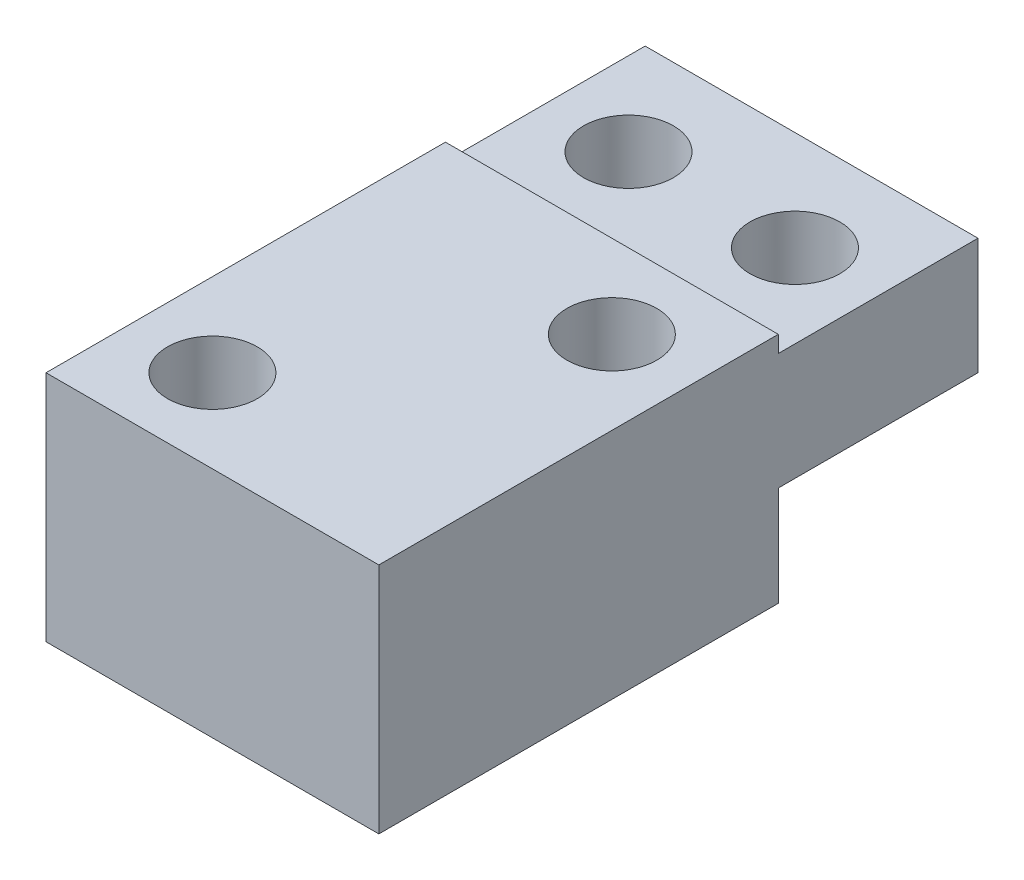
ISO-10303-21;
HEADER;
FILE_DESCRIPTION(('STEP AP214'),'2;1');
FILE_NAME('part.step','',(''),(''),'','','');
FILE_SCHEMA(('AUTOMOTIVE_DESIGN { 1 0 10303 214 1 1 1 1 }'));
ENDSEC;
DATA;
#1=APPLICATION_CONTEXT('core data for automotive mechanical design processes');
#2=APPLICATION_PROTOCOL_DEFINITION('international standard','automotive_design',2000,#1);
#3=PRODUCT_CONTEXT('',#1,'mechanical');
#4=PRODUCT('Part','Part','',(#3));
#5=PRODUCT_RELATED_PRODUCT_CATEGORY('part','',(#4));
#6=PRODUCT_DEFINITION_FORMATION('','',#4);
#7=PRODUCT_DEFINITION_CONTEXT('part definition',#1,'design');
#8=PRODUCT_DEFINITION('design','',#6,#7);
#9=PRODUCT_DEFINITION_SHAPE('','',#8);
#10=(LENGTH_UNIT() NAMED_UNIT(*) SI_UNIT(.MILLI.,.METRE.));
#11=(NAMED_UNIT(*) PLANE_ANGLE_UNIT() SI_UNIT($,.RADIAN.));
#12=(NAMED_UNIT(*) SI_UNIT($,.STERADIAN.) SOLID_ANGLE_UNIT());
#13=UNCERTAINTY_MEASURE_WITH_UNIT(LENGTH_MEASURE(1.E-05),#10,'distance_accuracy_value','');
#14=(GEOMETRIC_REPRESENTATION_CONTEXT(3) GLOBAL_UNCERTAINTY_ASSIGNED_CONTEXT((#13)) GLOBAL_UNIT_ASSIGNED_CONTEXT((#10,
#11,#12)) REPRESENTATION_CONTEXT('',''));
#15=CARTESIAN_POINT('',(0.,0.,0.));
#16=DIRECTION('',(0.,0.,1.));
#17=DIRECTION('',(1.,0.,0.));
#18=AXIS2_PLACEMENT_3D('',#15,#16,#17);
#19=CARTESIAN_POINT('',(-5.,7.,-9.));
#20=DIRECTION('',(0.,0.,1.));
#21=DIRECTION('',(1.,0.,0.));
#22=AXIS2_PLACEMENT_3D('',#19,#20,#21);
#23=PLANE('',#22);
#24=DIRECTION('',(1.,0.,0.));
#25=VECTOR('',#24,1.);
#26=CARTESIAN_POINT('',(0.,3.,-9.));
#27=LINE('',#26,#25);
#28=CARTESIAN_POINT('',(-5.,3.,-9.));
#29=VERTEX_POINT('',#28);
#30=CARTESIAN_POINT('',(5.,3.,-9.));
#31=VERTEX_POINT('',#30);
#32=EDGE_CURVE('E111',#29,#31,#27,.T.);
#33=ORIENTED_EDGE('',*,*,#32,.F.);
#34=DIRECTION('',(0.,-1.,0.));
#35=VECTOR('',#34,1.);
#36=CARTESIAN_POINT('',(-5.,7.,-9.));
#37=LINE('',#36,#35);
#38=CARTESIAN_POINT('',(-5.,6.5,-9.));
#39=VERTEX_POINT('',#38);
#40=EDGE_CURVE('E163',#39,#29,#37,.T.);
#41=ORIENTED_EDGE('',*,*,#40,.F.);
#42=DIRECTION('',(-1.,0.,0.));
#43=VECTOR('',#42,1.);
#44=CARTESIAN_POINT('',(-5.,6.5,-9.));
#45=LINE('',#44,#43);
#46=CARTESIAN_POINT('',(5.,6.5,-9.));
#47=VERTEX_POINT('',#46);
#48=EDGE_CURVE('E148',#47,#39,#45,.T.);
#49=ORIENTED_EDGE('',*,*,#48,.F.);
#50=DIRECTION('',(0.,-1.,0.));
#51=VECTOR('',#50,1.);
#52=CARTESIAN_POINT('',(5.,7.,-9.));
#53=LINE('',#52,#51);
#54=EDGE_CURVE('E170',#47,#31,#53,.T.);
#55=ORIENTED_EDGE('',*,*,#54,.T.);
#56=EDGE_LOOP('',(#33,#41,#49,#55));
#57=FACE_BOUND('',#56,.T.);
#58=ADVANCED_FACE('F35',(#57),#23,.F.);
#59=CARTESIAN_POINT('',(-5.,7.,-9.));
#60=DIRECTION('',(1.,0.,0.));
#61=DIRECTION('',(0.,0.,-1.));
#62=AXIS2_PLACEMENT_3D('',#59,#60,#61);
#63=PLANE('',#62);
#64=DIRECTION('',(0.,0.,-1.));
#65=VECTOR('',#64,1.);
#66=CARTESIAN_POINT('',(-5.,3.,0.));
#67=LINE('',#66,#65);
#68=CARTESIAN_POINT('',(-5.,3.,-3.));
#69=VERTEX_POINT('',#68);
#70=EDGE_CURVE('E105',#69,#29,#67,.T.);
#71=ORIENTED_EDGE('',*,*,#70,.F.);
#72=DIRECTION('',(0.,-1.,0.));
#73=VECTOR('',#72,1.);
#74=CARTESIAN_POINT('',(-5.,3.,-3.));
#75=LINE('',#74,#73);
#76=CARTESIAN_POINT('',(-5.,0.,-3.));
#77=VERTEX_POINT('',#76);
#78=EDGE_CURVE('E102',#69,#77,#75,.T.);
#79=ORIENTED_EDGE('',*,*,#78,.T.);
#80=DIRECTION('',(0.,0.,1.));
#81=VECTOR('',#80,1.);
#82=CARTESIAN_POINT('',(-5.,0.,-9.));
#83=LINE('',#82,#81);
#84=CARTESIAN_POINT('',(-5.,0.,9.));
#85=VERTEX_POINT('',#84);
#86=EDGE_CURVE('E154',#77,#85,#83,.T.);
#87=ORIENTED_EDGE('',*,*,#86,.T.);
#88=DIRECTION('',(0.,-1.,0.));
#89=VECTOR('',#88,1.);
#90=CARTESIAN_POINT('',(-5.,7.,9.));
#91=LINE('',#90,#89);
#92=CARTESIAN_POINT('',(-5.,7.,9.));
#93=VERTEX_POINT('',#92);
#94=EDGE_CURVE('E11',#93,#85,#91,.T.);
#95=ORIENTED_EDGE('',*,*,#94,.F.);
#96=DIRECTION('',(0.,0.,1.));
#97=VECTOR('',#96,1.);
#98=CARTESIAN_POINT('',(-5.,7.,-9.));
#99=LINE('',#98,#97);
#100=CARTESIAN_POINT('',(-5.,7.,-3.));
#101=VERTEX_POINT('',#100);
#102=EDGE_CURVE('E156',#101,#93,#99,.T.);
#103=ORIENTED_EDGE('',*,*,#102,.F.);
#104=DIRECTION('',(0.,1.,0.));
#105=VECTOR('',#104,1.);
#106=CARTESIAN_POINT('',(-5.,6.5,-3.));
#107=LINE('',#106,#105);
#108=CARTESIAN_POINT('',(-5.,6.5,-3.));
#109=VERTEX_POINT('',#108);
#110=EDGE_CURVE('E58',#109,#101,#107,.T.);
#111=ORIENTED_EDGE('',*,*,#110,.F.);
#112=DIRECTION('',(0.,0.,1.));
#113=VECTOR('',#112,1.);
#114=CARTESIAN_POINT('',(-5.,6.5,-9.));
#115=LINE('',#114,#113);
#116=EDGE_CURVE('E140',#39,#109,#115,.T.);
#117=ORIENTED_EDGE('',*,*,#116,.F.);
#118=ORIENTED_EDGE('',*,*,#40,.T.);
#119=EDGE_LOOP('',(#71,#79,#87,#95,#103,#111,#117,#118));
#120=FACE_BOUND('',#119,.T.);
#121=ADVANCED_FACE('F37',(#120),#63,.F.);
#122=CARTESIAN_POINT('',(-5.,7.,9.));
#123=DIRECTION('',(0.,0.,-1.));
#124=DIRECTION('',(-1.,0.,0.));
#125=AXIS2_PLACEMENT_3D('',#122,#123,#124);
#126=PLANE('',#125);
#127=DIRECTION('',(1.,0.,0.));
#128=VECTOR('',#127,1.);
#129=CARTESIAN_POINT('',(-5.,0.,9.));
#130=LINE('',#129,#128);
#131=CARTESIAN_POINT('',(5.,0.,9.));
#132=VERTEX_POINT('',#131);
#133=EDGE_CURVE('E165',#85,#132,#130,.T.);
#134=ORIENTED_EDGE('',*,*,#133,.T.);
#135=DIRECTION('',(0.,-1.,0.));
#136=VECTOR('',#135,1.);
#137=CARTESIAN_POINT('',(5.,7.,9.));
#138=LINE('',#137,#136);
#139=CARTESIAN_POINT('',(5.,7.,9.));
#140=VERTEX_POINT('',#139);
#141=EDGE_CURVE('E43',#140,#132,#138,.T.);
#142=ORIENTED_EDGE('',*,*,#141,.F.);
#143=DIRECTION('',(1.,0.,0.));
#144=VECTOR('',#143,1.);
#145=CARTESIAN_POINT('',(-5.,7.,9.));
#146=LINE('',#145,#144);
#147=EDGE_CURVE('E158',#93,#140,#146,.T.);
#148=ORIENTED_EDGE('',*,*,#147,.F.);
#149=ORIENTED_EDGE('',*,*,#94,.T.);
#150=EDGE_LOOP('',(#134,#142,#148,#149));
#151=FACE_BOUND('',#150,.T.);
#152=ADVANCED_FACE('F216',(#151),#126,.F.);
#153=CARTESIAN_POINT('',(5.,7.,-9.));
#154=DIRECTION('',(-1.,0.,0.));
#155=DIRECTION('',(0.,0.,1.));
#156=AXIS2_PLACEMENT_3D('',#153,#154,#155);
#157=PLANE('',#156);
#158=DIRECTION('',(0.,0.,-1.));
#159=VECTOR('',#158,1.);
#160=CARTESIAN_POINT('',(5.,0.,-9.));
#161=LINE('',#160,#159);
#162=CARTESIAN_POINT('',(5.,0.,-3.));
#163=VERTEX_POINT('',#162);
#164=EDGE_CURVE('E121',#132,#163,#161,.T.);
#165=ORIENTED_EDGE('',*,*,#164,.T.);
#166=DIRECTION('',(0.,-1.,0.));
#167=VECTOR('',#166,1.);
#168=CARTESIAN_POINT('',(5.,3.,-3.));
#169=LINE('',#168,#167);
#170=CARTESIAN_POINT('',(5.,3.,-3.));
#171=VERTEX_POINT('',#170);
#172=EDGE_CURVE('E50',#171,#163,#169,.T.);
#173=ORIENTED_EDGE('',*,*,#172,.F.);
#174=DIRECTION('',(0.,0.,1.));
#175=VECTOR('',#174,1.);
#176=CARTESIAN_POINT('',(5.,3.,0.));
#177=LINE('',#176,#175);
#178=EDGE_CURVE('E106',#31,#171,#177,.T.);
#179=ORIENTED_EDGE('',*,*,#178,.F.);
#180=ORIENTED_EDGE('',*,*,#54,.F.);
#181=DIRECTION('',(0.,0.,-1.));
#182=VECTOR('',#181,1.);
#183=CARTESIAN_POINT('',(5.,6.5,-9.));
#184=LINE('',#183,#182);
#185=CARTESIAN_POINT('',(5.,6.5,-3.));
#186=VERTEX_POINT('',#185);
#187=EDGE_CURVE('E146',#186,#47,#184,.T.);
#188=ORIENTED_EDGE('',*,*,#187,.F.);
#189=DIRECTION('',(0.,1.,0.));
#190=VECTOR('',#189,1.);
#191=CARTESIAN_POINT('',(5.,6.5,-3.));
#192=LINE('',#191,#190);
#193=CARTESIAN_POINT('',(5.,7.,-3.));
#194=VERTEX_POINT('',#193);
#195=EDGE_CURVE('E151',#186,#194,#192,.T.);
#196=ORIENTED_EDGE('',*,*,#195,.T.);
#197=DIRECTION('',(0.,0.,-1.));
#198=VECTOR('',#197,1.);
#199=CARTESIAN_POINT('',(5.,7.,-9.));
#200=LINE('',#199,#198);
#201=EDGE_CURVE('E160',#140,#194,#200,.T.);
#202=ORIENTED_EDGE('',*,*,#201,.F.);
#203=ORIENTED_EDGE('',*,*,#141,.T.);
#204=EDGE_LOOP('',(#165,#173,#179,#180,#188,#196,#202,#203));
#205=FACE_BOUND('',#204,.T.);
#206=ADVANCED_FACE('F118',(#205),#157,.F.);
#207=CARTESIAN_POINT('',(0.,7.,0.));
#208=DIRECTION('',(0.,1.,0.));
#209=DIRECTION('',(0.,0.,1.));
#210=AXIS2_PLACEMENT_3D('',#207,#208,#209);
#211=PLANE('',#210);
#212=CARTESIAN_POINT('',(-2.5,7.,6.5));
#213=DIRECTION('',(0.,1.,0.));
#214=DIRECTION('',(0.,0.,1.));
#215=AXIS2_PLACEMENT_3D('',#212,#213,#214);
#216=CIRCLE('',#215,1.34999999999999);
#217=CARTESIAN_POINT('',(-2.5,7.,7.84999999999999));
#218=VERTEX_POINT('',#217);
#219=EDGE_CURVE('E123',#218,#218,#216,.T.);
#220=ORIENTED_EDGE('',*,*,#219,.F.);
#221=EDGE_LOOP('',(#220));
#222=FACE_BOUND('',#221,.T.);
#223=CARTESIAN_POINT('',(2.5,7.,-0.499999999999999));
#224=DIRECTION('',(0.,1.,0.));
#225=DIRECTION('',(0.,0.,1.));
#226=AXIS2_PLACEMENT_3D('',#223,#224,#225);
#227=CIRCLE('',#226,1.34999999999999);
#228=CARTESIAN_POINT('',(2.5,7.,0.849999999999989));
#229=VERTEX_POINT('',#228);
#230=EDGE_CURVE('E133',#229,#229,#227,.T.);
#231=ORIENTED_EDGE('',*,*,#230,.F.);
#232=EDGE_LOOP('',(#231));
#233=FACE_BOUND('',#232,.T.);
#234=DIRECTION('',(1.,0.,0.));
#235=VECTOR('',#234,1.);
#236=CARTESIAN_POINT('',(-5.,7.,-3.));
#237=LINE('',#236,#235);
#238=EDGE_CURVE('E139',#101,#194,#237,.T.);
#239=ORIENTED_EDGE('',*,*,#238,.F.);
#240=ORIENTED_EDGE('',*,*,#102,.T.);
#241=ORIENTED_EDGE('',*,*,#147,.T.);
#242=ORIENTED_EDGE('',*,*,#201,.T.);
#243=EDGE_LOOP('',(#239,#240,#241,#242));
#244=FACE_BOUND('',#243,.T.);
#245=ADVANCED_FACE('F222',(#222,#233,#244),#211,.T.);
#246=CARTESIAN_POINT('',(0.,0.,0.));
#247=DIRECTION('',(0.,1.,0.));
#248=DIRECTION('',(0.,0.,1.));
#249=AXIS2_PLACEMENT_3D('',#246,#247,#248);
#250=PLANE('',#249);
#251=CARTESIAN_POINT('',(-2.5,0.,6.5));
#252=DIRECTION('',(0.,1.,0.));
#253=DIRECTION('',(0.,0.,1.));
#254=AXIS2_PLACEMENT_3D('',#251,#252,#253);
#255=CIRCLE('',#254,1.35);
#256=CARTESIAN_POINT('',(-2.5,0.,7.85));
#257=VERTEX_POINT('',#256);
#258=EDGE_CURVE('E130',#257,#257,#255,.T.);
#259=ORIENTED_EDGE('',*,*,#258,.T.);
#260=EDGE_LOOP('',(#259));
#261=FACE_BOUND('',#260,.T.);
#262=CARTESIAN_POINT('',(2.5,0.,-0.499999999999999));
#263=DIRECTION('',(0.,1.,0.));
#264=DIRECTION('',(0.,0.,1.));
#265=AXIS2_PLACEMENT_3D('',#262,#263,#264);
#266=CIRCLE('',#265,1.35);
#267=CARTESIAN_POINT('',(2.5,0.,0.849999999999999));
#268=VERTEX_POINT('',#267);
#269=EDGE_CURVE('E136',#268,#268,#266,.T.);
#270=ORIENTED_EDGE('',*,*,#269,.T.);
#271=EDGE_LOOP('',(#270));
#272=FACE_BOUND('',#271,.T.);
#273=ORIENTED_EDGE('',*,*,#86,.F.);
#274=DIRECTION('',(-1.,0.,0.));
#275=VECTOR('',#274,1.);
#276=CARTESIAN_POINT('',(0.,0.,-3.));
#277=LINE('',#276,#275);
#278=EDGE_CURVE('E115',#163,#77,#277,.T.);
#279=ORIENTED_EDGE('',*,*,#278,.F.);
#280=ORIENTED_EDGE('',*,*,#164,.F.);
#281=ORIENTED_EDGE('',*,*,#133,.F.);
#282=EDGE_LOOP('',(#273,#279,#280,#281));
#283=FACE_BOUND('',#282,.T.);
#284=ADVANCED_FACE('F178',(#261,#272,#283),#250,.F.);
#285=CARTESIAN_POINT('',(-5.,6.5,-3.));
#286=DIRECTION('',(0.,0.,1.));
#287=DIRECTION('',(1.,0.,0.));
#288=AXIS2_PLACEMENT_3D('',#285,#286,#287);
#289=PLANE('',#288);
#290=ORIENTED_EDGE('',*,*,#238,.T.);
#291=ORIENTED_EDGE('',*,*,#195,.F.);
#292=DIRECTION('',(1.,0.,0.));
#293=VECTOR('',#292,1.);
#294=CARTESIAN_POINT('',(-5.,6.5,-3.));
#295=LINE('',#294,#293);
#296=EDGE_CURVE('E143',#109,#186,#295,.T.);
#297=ORIENTED_EDGE('',*,*,#296,.F.);
#298=ORIENTED_EDGE('',*,*,#110,.T.);
#299=EDGE_LOOP('',(#290,#291,#297,#298));
#300=FACE_BOUND('',#299,.T.);
#301=ADVANCED_FACE('F234',(#300),#289,.F.);
#302=CARTESIAN_POINT('',(0.,6.5,0.));
#303=DIRECTION('',(0.,1.,0.));
#304=DIRECTION('',(0.,0.,1.));
#305=AXIS2_PLACEMENT_3D('',#302,#303,#304);
#306=PLANE('',#305);
#307=CARTESIAN_POINT('',(2.5,6.5,-6.));
#308=DIRECTION('',(0.,1.,0.));
#309=DIRECTION('',(0.,0.,1.));
#310=AXIS2_PLACEMENT_3D('',#307,#308,#309);
#311=CIRCLE('',#310,1.35);
#312=CARTESIAN_POINT('',(2.5,6.5,-4.65));
#313=VERTEX_POINT('',#312);
#314=EDGE_CURVE('E187',#313,#313,#311,.T.);
#315=ORIENTED_EDGE('',*,*,#314,.F.);
#316=EDGE_LOOP('',(#315));
#317=FACE_BOUND('',#316,.T.);
#318=CARTESIAN_POINT('',(-2.5,6.5,-6.));
#319=DIRECTION('',(0.,1.,0.));
#320=DIRECTION('',(0.,0.,1.));
#321=AXIS2_PLACEMENT_3D('',#318,#319,#320);
#322=CIRCLE('',#321,1.35);
#323=CARTESIAN_POINT('',(-2.5,6.5,-4.65));
#324=VERTEX_POINT('',#323);
#325=EDGE_CURVE('E179',#324,#324,#322,.T.);
#326=ORIENTED_EDGE('',*,*,#325,.F.);
#327=EDGE_LOOP('',(#326));
#328=FACE_BOUND('',#327,.T.);
#329=ORIENTED_EDGE('',*,*,#116,.T.);
#330=ORIENTED_EDGE('',*,*,#296,.T.);
#331=ORIENTED_EDGE('',*,*,#187,.T.);
#332=ORIENTED_EDGE('',*,*,#48,.T.);
#333=EDGE_LOOP('',(#329,#330,#331,#332));
#334=FACE_BOUND('',#333,.T.);
#335=ADVANCED_FACE('F233',(#317,#328,#334),#306,.T.);
#336=CARTESIAN_POINT('',(2.5,7.,-0.499999999999999));
#337=DIRECTION('',(0.,1.,0.));
#338=DIRECTION('',(0.,0.,1.));
#339=AXIS2_PLACEMENT_3D('',#336,#337,#338);
#340=CYLINDRICAL_SURFACE('',#339,1.34999999999999);
#341=ORIENTED_EDGE('',*,*,#269,.F.);
#342=EDGE_LOOP('',(#341));
#343=FACE_BOUND('',#342,.T.);
#344=ORIENTED_EDGE('',*,*,#230,.T.);
#345=EDGE_LOOP('',(#344));
#346=FACE_BOUND('',#345,.T.);
#347=ADVANCED_FACE('F249',(#343,#346),#340,.F.);
#348=CARTESIAN_POINT('',(-2.5,7.,6.5));
#349=DIRECTION('',(0.,1.,0.));
#350=DIRECTION('',(0.,0.,1.));
#351=AXIS2_PLACEMENT_3D('',#348,#349,#350);
#352=CYLINDRICAL_SURFACE('',#351,1.34999999999999);
#353=ORIENTED_EDGE('',*,*,#258,.F.);
#354=EDGE_LOOP('',(#353));
#355=FACE_BOUND('',#354,.T.);
#356=ORIENTED_EDGE('',*,*,#219,.T.);
#357=EDGE_LOOP('',(#356));
#358=FACE_BOUND('',#357,.T.);
#359=ADVANCED_FACE('F253',(#355,#358),#352,.F.);
#360=CARTESIAN_POINT('',(0.,3.,-3.));
#361=DIRECTION('',(0.,0.,1.));
#362=DIRECTION('',(1.,0.,0.));
#363=AXIS2_PLACEMENT_3D('',#360,#361,#362);
#364=PLANE('',#363);
#365=ORIENTED_EDGE('',*,*,#278,.T.);
#366=ORIENTED_EDGE('',*,*,#78,.F.);
#367=DIRECTION('',(-1.,0.,0.));
#368=VECTOR('',#367,1.);
#369=CARTESIAN_POINT('',(0.,3.,-3.));
#370=LINE('',#369,#368);
#371=EDGE_CURVE('E98',#171,#69,#370,.T.);
#372=ORIENTED_EDGE('',*,*,#371,.F.);
#373=ORIENTED_EDGE('',*,*,#172,.T.);
#374=EDGE_LOOP('',(#365,#366,#372,#373));
#375=FACE_BOUND('',#374,.T.);
#376=ADVANCED_FACE('F100',(#375),#364,.F.);
#377=CARTESIAN_POINT('',(0.,3.,0.));
#378=DIRECTION('',(0.,-1.,0.));
#379=DIRECTION('',(0.,0.,-1.));
#380=AXIS2_PLACEMENT_3D('',#377,#378,#379);
#381=PLANE('',#380);
#382=CARTESIAN_POINT('',(2.5,3.,-6.));
#383=DIRECTION('',(0.,-1.,0.));
#384=DIRECTION('',(0.,0.,-1.));
#385=AXIS2_PLACEMENT_3D('',#382,#383,#384);
#386=CIRCLE('',#385,1.35);
#387=CARTESIAN_POINT('',(2.5,3.,-7.35));
#388=VERTEX_POINT('',#387);
#389=EDGE_CURVE('E190',#388,#388,#386,.T.);
#390=ORIENTED_EDGE('',*,*,#389,.F.);
#391=EDGE_LOOP('',(#390));
#392=FACE_BOUND('',#391,.T.);
#393=CARTESIAN_POINT('',(-2.5,3.,-6.));
#394=DIRECTION('',(0.,-1.,0.));
#395=DIRECTION('',(0.,0.,-1.));
#396=AXIS2_PLACEMENT_3D('',#393,#394,#395);
#397=CIRCLE('',#396,1.35);
#398=CARTESIAN_POINT('',(-2.5,3.,-7.35));
#399=VERTEX_POINT('',#398);
#400=EDGE_CURVE('E181',#399,#399,#397,.T.);
#401=ORIENTED_EDGE('',*,*,#400,.F.);
#402=EDGE_LOOP('',(#401));
#403=FACE_BOUND('',#402,.T.);
#404=ORIENTED_EDGE('',*,*,#178,.T.);
#405=ORIENTED_EDGE('',*,*,#371,.T.);
#406=ORIENTED_EDGE('',*,*,#70,.T.);
#407=ORIENTED_EDGE('',*,*,#32,.T.);
#408=EDGE_LOOP('',(#404,#405,#406,#407));
#409=FACE_BOUND('',#408,.T.);
#410=ADVANCED_FACE('F109',(#392,#403,#409),#381,.T.);
#411=CARTESIAN_POINT('',(-2.5,3.,-6.));
#412=DIRECTION('',(0.,-1.,0.));
#413=DIRECTION('',(0.,0.,-1.));
#414=AXIS2_PLACEMENT_3D('',#411,#412,#413);
#415=CYLINDRICAL_SURFACE('',#414,1.35);
#416=ORIENTED_EDGE('',*,*,#325,.T.);
#417=EDGE_LOOP('',(#416));
#418=FACE_BOUND('',#417,.T.);
#419=ORIENTED_EDGE('',*,*,#400,.T.);
#420=EDGE_LOOP('',(#419));
#421=FACE_BOUND('',#420,.T.);
#422=ADVANCED_FACE('F198',(#418,#421),#415,.F.);
#423=CARTESIAN_POINT('',(2.5,3.,-6.));
#424=DIRECTION('',(0.,-1.,0.));
#425=DIRECTION('',(0.,0.,-1.));
#426=AXIS2_PLACEMENT_3D('',#423,#424,#425);
#427=CYLINDRICAL_SURFACE('',#426,1.35);
#428=ORIENTED_EDGE('',*,*,#314,.T.);
#429=EDGE_LOOP('',(#428));
#430=FACE_BOUND('',#429,.T.);
#431=ORIENTED_EDGE('',*,*,#389,.T.);
#432=EDGE_LOOP('',(#431));
#433=FACE_BOUND('',#432,.T.);
#434=ADVANCED_FACE('F194',(#430,#433),#427,.F.);
#435=CLOSED_SHELL('',(#58,#121,#152,#206,#245,#284,#301,#335,#347,#359,#376,#410,#422,#434));
#436=MANIFOLD_SOLID_BREP('B2',#435);
#437=ADVANCED_BREP_SHAPE_REPRESENTATION('',(#18,#436),#14);
#438=SHAPE_DEFINITION_REPRESENTATION(#9,#437);
ENDSEC;
END-ISO-10303-21;
